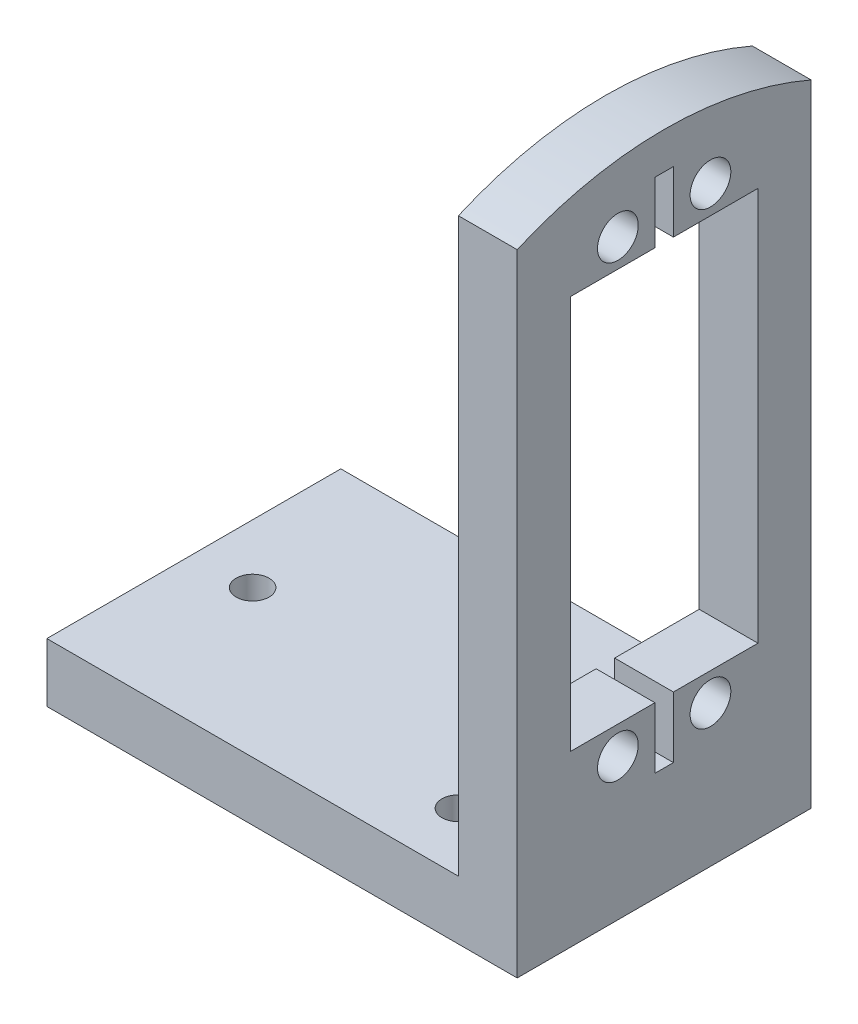
ISO-10303-21;
HEADER;
FILE_DESCRIPTION(('STEP AP214'),'2;1');
FILE_NAME('part.step','',(''),(''),'','','');
FILE_SCHEMA(('AUTOMOTIVE_DESIGN { 1 0 10303 214 1 1 1 1 }'));
ENDSEC;
DATA;
#1=APPLICATION_CONTEXT('core data for automotive mechanical design processes');
#2=APPLICATION_PROTOCOL_DEFINITION('international standard','automotive_design',2000,#1);
#3=PRODUCT_CONTEXT('',#1,'mechanical');
#4=PRODUCT('Part','Part','',(#3));
#5=PRODUCT_RELATED_PRODUCT_CATEGORY('part','',(#4));
#6=PRODUCT_DEFINITION_FORMATION('','',#4);
#7=PRODUCT_DEFINITION_CONTEXT('part definition',#1,'design');
#8=PRODUCT_DEFINITION('design','',#6,#7);
#9=PRODUCT_DEFINITION_SHAPE('','',#8);
#10=(LENGTH_UNIT() NAMED_UNIT(*) SI_UNIT(.MILLI.,.METRE.));
#11=(NAMED_UNIT(*) PLANE_ANGLE_UNIT() SI_UNIT($,.RADIAN.));
#12=(NAMED_UNIT(*) SI_UNIT($,.STERADIAN.) SOLID_ANGLE_UNIT());
#13=UNCERTAINTY_MEASURE_WITH_UNIT(LENGTH_MEASURE(1.E-05),#10,'distance_accuracy_value','');
#14=(GEOMETRIC_REPRESENTATION_CONTEXT(3) GLOBAL_UNCERTAINTY_ASSIGNED_CONTEXT((#13)) GLOBAL_UNIT_ASSIGNED_CONTEXT((#10,
#11,#12)) REPRESENTATION_CONTEXT('',''));
#15=CARTESIAN_POINT('',(0.,0.,0.));
#16=DIRECTION('',(0.,0.,1.));
#17=DIRECTION('',(1.,0.,0.));
#18=AXIS2_PLACEMENT_3D('',#15,#16,#17);
#19=CARTESIAN_POINT('',(6.35,0.,0.));
#20=DIRECTION('',(-1.,0.,0.));
#21=DIRECTION('',(0.,0.,1.));
#22=AXIS2_PLACEMENT_3D('',#19,#20,#21);
#23=PLANE('',#22);
#24=CARTESIAN_POINT('',(6.35,57.535000119,-20.875000033));
#25=DIRECTION('',(1.,0.,0.));
#26=DIRECTION('',(0.,0.,-1.));
#27=AXIS2_PLACEMENT_3D('',#24,#25,#26);
#28=CIRCLE('',#27,2.20000004499998);
#29=CARTESIAN_POINT('',(6.35,57.535000119,-23.075000078));
#30=VERTEX_POINT('',#29);
#31=EDGE_CURVE('E298',#30,#30,#28,.T.);
#32=ORIENTED_EDGE('',*,*,#31,.F.);
#33=EDGE_LOOP('',(#32));
#34=FACE_BOUND('',#33,.T.);
#35=CARTESIAN_POINT('',(6.35,57.535000119,-10.874999967));
#36=DIRECTION('',(1.,0.,0.));
#37=DIRECTION('',(0.,0.,-1.));
#38=AXIS2_PLACEMENT_3D('',#35,#36,#37);
#39=CIRCLE('',#38,2.20000004499999);
#40=CARTESIAN_POINT('',(6.35,57.535000119,-13.075000012));
#41=VERTEX_POINT('',#40);
#42=EDGE_CURVE('E304',#41,#41,#39,.T.);
#43=ORIENTED_EDGE('',*,*,#42,.F.);
#44=EDGE_LOOP('',(#43));
#45=FACE_BOUND('',#44,.T.);
#46=CARTESIAN_POINT('',(6.35,8.93500003700001,-20.875000033));
#47=DIRECTION('',(1.,0.,0.));
#48=DIRECTION('',(0.,0.,-1.));
#49=AXIS2_PLACEMENT_3D('',#46,#47,#48);
#50=CIRCLE('',#49,2.200000045);
#51=CARTESIAN_POINT('',(6.35,8.93500003700001,-23.075000078));
#52=VERTEX_POINT('',#51);
#53=EDGE_CURVE('E310',#52,#52,#50,.T.);
#54=ORIENTED_EDGE('',*,*,#53,.F.);
#55=EDGE_LOOP('',(#54));
#56=FACE_BOUND('',#55,.T.);
#57=CARTESIAN_POINT('',(6.35,8.93500003700001,-10.874999967));
#58=DIRECTION('',(1.,0.,0.));
#59=DIRECTION('',(0.,0.,-1.));
#60=AXIS2_PLACEMENT_3D('',#57,#58,#59);
#61=CIRCLE('',#60,2.200000045);
#62=CARTESIAN_POINT('',(6.35,8.93500003700001,-13.075000012));
#63=VERTEX_POINT('',#62);
#64=EDGE_CURVE('E186',#63,#63,#61,.T.);
#65=ORIENTED_EDGE('',*,*,#64,.F.);
#66=EDGE_LOOP('',(#65));
#67=FACE_BOUND('',#66,.T.);
#68=DIRECTION('',(0.,1.,0.));
#69=VECTOR('',#68,1.);
#70=CARTESIAN_POINT('',(6.35,0.,-31.75));
#71=LINE('',#70,#69);
#72=CARTESIAN_POINT('',(6.35,-6.34999999999999,-31.75));
#73=VERTEX_POINT('',#72);
#74=CARTESIAN_POINT('',(6.35,61.774194578712,-31.75));
#75=VERTEX_POINT('',#74);
#76=EDGE_CURVE('E11',#73,#75,#71,.T.);
#77=ORIENTED_EDGE('',*,*,#76,.T.);
#78=CARTESIAN_POINT('',(6.35,25.4,-15.875));
#79=DIRECTION('',(-1.,0.,0.));
#80=DIRECTION('',(0.,0.,-1.));
#81=AXIS2_PLACEMENT_3D('',#78,#79,#80);
#82=CIRCLE('',#81,39.6875);
#83=CARTESIAN_POINT('',(6.35,61.774194578712,0.));
#84=VERTEX_POINT('',#83);
#85=EDGE_CURVE('E53',#84,#75,#82,.T.);
#86=ORIENTED_EDGE('',*,*,#85,.F.);
#87=DIRECTION('',(0.,-1.,0.));
#88=VECTOR('',#87,1.);
#89=CARTESIAN_POINT('',(6.35,0.,0.));
#90=LINE('',#89,#88);
#91=CARTESIAN_POINT('',(6.35,-6.35,0.));
#92=VERTEX_POINT('',#91);
#93=EDGE_CURVE('E45',#84,#92,#90,.T.);
#94=ORIENTED_EDGE('',*,*,#93,.T.);
#95=DIRECTION('',(0.,0.,-1.));
#96=VECTOR('',#95,1.);
#97=CARTESIAN_POINT('',(6.35,-6.35,0.));
#98=LINE('',#97,#96);
#99=EDGE_CURVE('E697',#92,#73,#98,.T.);
#100=ORIENTED_EDGE('',*,*,#99,.T.);
#101=EDGE_LOOP('',(#77,#86,#94,#100));
#102=FACE_BOUND('',#101,.T.);
#103=DIRECTION('',(0.,-1.,0.));
#104=VECTOR('',#103,1.);
#105=CARTESIAN_POINT('',(6.35,54.507500078,-5.74800006099999));
#106=LINE('',#105,#104);
#107=CARTESIAN_POINT('',(6.35,54.507500078,-5.74800006099999));
#108=VERTEX_POINT('',#107);
#109=CARTESIAN_POINT('',(6.35,11.962500078,-5.74800006099999));
#110=VERTEX_POINT('',#109);
#111=EDGE_CURVE('E213',#108,#110,#106,.T.);
#112=ORIENTED_EDGE('',*,*,#111,.F.);
#113=DIRECTION('',(0.,0.,1.));
#114=VECTOR('',#113,1.);
#115=CARTESIAN_POINT('',(6.35,54.507500078,-5.74800006099999));
#116=LINE('',#115,#114);
#117=CARTESIAN_POINT('',(6.35,54.507500078,-14.875));
#118=VERTEX_POINT('',#117);
#119=EDGE_CURVE('E236',#118,#108,#116,.T.);
#120=ORIENTED_EDGE('',*,*,#119,.F.);
#121=DIRECTION('',(0.,-1.,0.));
#122=VECTOR('',#121,1.);
#123=CARTESIAN_POINT('',(6.35,54.507500078,-14.875));
#124=LINE('',#123,#122);
#125=CARTESIAN_POINT('',(6.35,61.1115000779998,-14.875));
#126=VERTEX_POINT('',#125);
#127=EDGE_CURVE('E234',#126,#118,#124,.T.);
#128=ORIENTED_EDGE('',*,*,#127,.F.);
#129=DIRECTION('',(0.,0.,1.));
#130=VECTOR('',#129,1.);
#131=CARTESIAN_POINT('',(6.35,61.1115000779998,-14.875));
#132=LINE('',#131,#130);
#133=CARTESIAN_POINT('',(6.35,61.1115000779998,-16.875));
#134=VERTEX_POINT('',#133);
#135=EDGE_CURVE('E232',#134,#126,#132,.T.);
#136=ORIENTED_EDGE('',*,*,#135,.F.);
#137=DIRECTION('',(0.,1.,0.));
#138=VECTOR('',#137,1.);
#139=CARTESIAN_POINT('',(6.35,54.507500078,-16.875));
#140=LINE('',#139,#138);
#141=CARTESIAN_POINT('',(6.35,54.507500078,-16.875));
#142=VERTEX_POINT('',#141);
#143=EDGE_CURVE('E230',#142,#134,#140,.T.);
#144=ORIENTED_EDGE('',*,*,#143,.F.);
#145=DIRECTION('',(0.,0.,1.));
#146=VECTOR('',#145,1.);
#147=CARTESIAN_POINT('',(6.35,54.507500078,-16.875));
#148=LINE('',#147,#146);
#149=CARTESIAN_POINT('',(6.35,54.507500078,-26.001999939));
#150=VERTEX_POINT('',#149);
#151=EDGE_CURVE('E228',#150,#142,#148,.T.);
#152=ORIENTED_EDGE('',*,*,#151,.F.);
#153=DIRECTION('',(0.,1.,0.));
#154=VECTOR('',#153,1.);
#155=CARTESIAN_POINT('',(6.35,54.507500078,-26.001999939));
#156=LINE('',#155,#154);
#157=CARTESIAN_POINT('',(6.35,11.962500078,-26.001999939));
#158=VERTEX_POINT('',#157);
#159=EDGE_CURVE('E226',#158,#150,#156,.T.);
#160=ORIENTED_EDGE('',*,*,#159,.F.);
#161=DIRECTION('',(0.,0.,-1.));
#162=VECTOR('',#161,1.);
#163=CARTESIAN_POINT('',(6.35,11.962500078,-16.875));
#164=LINE('',#163,#162);
#165=CARTESIAN_POINT('',(6.35,11.962500078,-16.875));
#166=VERTEX_POINT('',#165);
#167=EDGE_CURVE('E224',#166,#158,#164,.T.);
#168=ORIENTED_EDGE('',*,*,#167,.F.);
#169=DIRECTION('',(0.,1.,0.));
#170=VECTOR('',#169,1.);
#171=CARTESIAN_POINT('',(6.35,11.962500078,-16.875));
#172=LINE('',#171,#170);
#173=CARTESIAN_POINT('',(6.35,5.358500078,-16.875));
#174=VERTEX_POINT('',#173);
#175=EDGE_CURVE('E222',#174,#166,#172,.T.);
#176=ORIENTED_EDGE('',*,*,#175,.F.);
#177=DIRECTION('',(0.,-1.20129600711394E-13,-1.));
#178=VECTOR('',#177,1.);
#179=CARTESIAN_POINT('',(6.35,5.35850007800024,-14.875));
#180=LINE('',#179,#178);
#181=CARTESIAN_POINT('',(6.35,5.35850007800024,-14.875));
#182=VERTEX_POINT('',#181);
#183=EDGE_CURVE('E220',#182,#174,#180,.T.);
#184=ORIENTED_EDGE('',*,*,#183,.F.);
#185=DIRECTION('',(0.,-1.,0.));
#186=VECTOR('',#185,1.);
#187=CARTESIAN_POINT('',(6.35,11.962500078,-14.875));
#188=LINE('',#187,#186);
#189=CARTESIAN_POINT('',(6.35,11.962500078,-14.875));
#190=VERTEX_POINT('',#189);
#191=EDGE_CURVE('E218',#190,#182,#188,.T.);
#192=ORIENTED_EDGE('',*,*,#191,.F.);
#193=DIRECTION('',(0.,0.,-1.));
#194=VECTOR('',#193,1.);
#195=CARTESIAN_POINT('',(6.35,11.962500078,-5.74800006099999));
#196=LINE('',#195,#194);
#197=EDGE_CURVE('E215',#110,#190,#196,.T.);
#198=ORIENTED_EDGE('',*,*,#197,.F.);
#199=EDGE_LOOP('',(#112,#120,#128,#136,#144,#152,#160,#168,#176,#184,#192,#198));
#200=FACE_BOUND('',#199,.T.);
#201=ADVANCED_FACE('F36',(#34,#45,#56,#67,#102,#200),#23,.F.);
#202=CARTESIAN_POINT('',(0.,0.,0.));
#203=DIRECTION('',(-1.,0.,0.));
#204=DIRECTION('',(0.,0.,1.));
#205=AXIS2_PLACEMENT_3D('',#202,#203,#204);
#206=PLANE('',#205);
#207=CARTESIAN_POINT('',(0.,25.4,-15.875));
#208=DIRECTION('',(-1.,0.,0.));
#209=DIRECTION('',(0.,0.,1.));
#210=AXIS2_PLACEMENT_3D('',#207,#208,#209);
#211=CIRCLE('',#210,39.6875);
#212=CARTESIAN_POINT('',(0.,61.774194578712,-31.75));
#213=VERTEX_POINT('',#212);
#214=CARTESIAN_POINT('',(0.,61.774194578712,0.));
#215=VERTEX_POINT('',#214);
#216=EDGE_CURVE('E164',#213,#215,#211,.F.);
#217=ORIENTED_EDGE('',*,*,#216,.F.);
#218=DIRECTION('',(0.,1.,0.));
#219=VECTOR('',#218,1.);
#220=CARTESIAN_POINT('',(0.,0.,-31.75));
#221=LINE('',#220,#219);
#222=CARTESIAN_POINT('',(0.,0.,-31.75));
#223=VERTEX_POINT('',#222);
#224=EDGE_CURVE('E40',#223,#213,#221,.T.);
#225=ORIENTED_EDGE('',*,*,#224,.F.);
#226=DIRECTION('',(0.,0.,-1.));
#227=VECTOR('',#226,1.);
#228=CARTESIAN_POINT('',(0.,0.,0.));
#229=LINE('',#228,#227);
#230=CARTESIAN_POINT('',(0.,0.,0.));
#231=VERTEX_POINT('',#230);
#232=EDGE_CURVE('E180',#231,#223,#229,.T.);
#233=ORIENTED_EDGE('',*,*,#232,.F.);
#234=DIRECTION('',(0.,-1.,0.));
#235=VECTOR('',#234,1.);
#236=CARTESIAN_POINT('',(0.,0.,0.));
#237=LINE('',#236,#235);
#238=EDGE_CURVE('E185',#215,#231,#237,.T.);
#239=ORIENTED_EDGE('',*,*,#238,.F.);
#240=EDGE_LOOP('',(#217,#225,#233,#239));
#241=FACE_BOUND('',#240,.T.);
#242=CARTESIAN_POINT('',(0.,57.535000119,-10.874999967));
#243=DIRECTION('',(1.,0.,0.));
#244=DIRECTION('',(0.,0.,-1.));
#245=AXIS2_PLACEMENT_3D('',#242,#243,#244);
#246=CIRCLE('',#245,2.20000004499999);
#247=CARTESIAN_POINT('',(0.,57.535000119,-13.075000012));
#248=VERTEX_POINT('',#247);
#249=EDGE_CURVE('E301',#248,#248,#246,.T.);
#250=ORIENTED_EDGE('',*,*,#249,.T.);
#251=EDGE_LOOP('',(#250));
#252=FACE_BOUND('',#251,.T.);
#253=CARTESIAN_POINT('',(0.,8.93500003700001,-10.874999967));
#254=DIRECTION('',(1.,0.,0.));
#255=DIRECTION('',(0.,0.,-1.));
#256=AXIS2_PLACEMENT_3D('',#253,#254,#255);
#257=CIRCLE('',#256,2.200000045);
#258=CARTESIAN_POINT('',(0.,8.93500003700001,-13.075000012));
#259=VERTEX_POINT('',#258);
#260=EDGE_CURVE('E182',#259,#259,#257,.T.);
#261=ORIENTED_EDGE('',*,*,#260,.T.);
#262=EDGE_LOOP('',(#261));
#263=FACE_BOUND('',#262,.T.);
#264=CARTESIAN_POINT('',(0.,8.93500003700001,-20.875000033));
#265=DIRECTION('',(1.,0.,0.));
#266=DIRECTION('',(0.,0.,-1.));
#267=AXIS2_PLACEMENT_3D('',#264,#265,#266);
#268=CIRCLE('',#267,2.200000045);
#269=CARTESIAN_POINT('',(0.,8.93500003700001,-23.075000078));
#270=VERTEX_POINT('',#269);
#271=EDGE_CURVE('E307',#270,#270,#268,.T.);
#272=ORIENTED_EDGE('',*,*,#271,.T.);
#273=EDGE_LOOP('',(#272));
#274=FACE_BOUND('',#273,.T.);
#275=CARTESIAN_POINT('',(0.,57.535000119,-20.875000033));
#276=DIRECTION('',(1.,0.,0.));
#277=DIRECTION('',(0.,0.,-1.));
#278=AXIS2_PLACEMENT_3D('',#275,#276,#277);
#279=CIRCLE('',#278,2.20000004499998);
#280=CARTESIAN_POINT('',(0.,57.535000119,-23.075000078));
#281=VERTEX_POINT('',#280);
#282=EDGE_CURVE('E297',#281,#281,#279,.T.);
#283=ORIENTED_EDGE('',*,*,#282,.T.);
#284=EDGE_LOOP('',(#283));
#285=FACE_BOUND('',#284,.T.);
#286=DIRECTION('',(0.,0.,1.));
#287=VECTOR('',#286,1.);
#288=CARTESIAN_POINT('',(0.,54.507500078,-5.74800006099999));
#289=LINE('',#288,#287);
#290=CARTESIAN_POINT('',(0.,54.507500078,-14.875));
#291=VERTEX_POINT('',#290);
#292=CARTESIAN_POINT('',(0.,54.507500078,-5.74800006099999));
#293=VERTEX_POINT('',#292);
#294=EDGE_CURVE('E216',#291,#293,#289,.T.);
#295=ORIENTED_EDGE('',*,*,#294,.T.);
#296=DIRECTION('',(0.,-1.,0.));
#297=VECTOR('',#296,1.);
#298=CARTESIAN_POINT('',(0.,54.507500078,-5.74800006099999));
#299=LINE('',#298,#297);
#300=CARTESIAN_POINT('',(0.,11.962500078,-5.74800006099999));
#301=VERTEX_POINT('',#300);
#302=EDGE_CURVE('E205',#293,#301,#299,.T.);
#303=ORIENTED_EDGE('',*,*,#302,.T.);
#304=DIRECTION('',(0.,0.,-1.));
#305=VECTOR('',#304,1.);
#306=CARTESIAN_POINT('',(0.,11.962500078,-5.74800006099999));
#307=LINE('',#306,#305);
#308=CARTESIAN_POINT('',(0.,11.962500078,-14.875));
#309=VERTEX_POINT('',#308);
#310=EDGE_CURVE('E241',#301,#309,#307,.T.);
#311=ORIENTED_EDGE('',*,*,#310,.T.);
#312=DIRECTION('',(0.,-1.,0.));
#313=VECTOR('',#312,1.);
#314=CARTESIAN_POINT('',(0.,11.962500078,-14.875));
#315=LINE('',#314,#313);
#316=CARTESIAN_POINT('',(0.,5.35850007800024,-14.875));
#317=VERTEX_POINT('',#316);
#318=EDGE_CURVE('E244',#309,#317,#315,.T.);
#319=ORIENTED_EDGE('',*,*,#318,.T.);
#320=DIRECTION('',(0.,-1.20129600711394E-13,-1.));
#321=VECTOR('',#320,1.);
#322=CARTESIAN_POINT('',(0.,5.35850007800024,-14.875));
#323=LINE('',#322,#321);
#324=CARTESIAN_POINT('',(0.,5.358500078,-16.875));
#325=VERTEX_POINT('',#324);
#326=EDGE_CURVE('E247',#317,#325,#323,.T.);
#327=ORIENTED_EDGE('',*,*,#326,.T.);
#328=DIRECTION('',(0.,1.,0.));
#329=VECTOR('',#328,1.);
#330=CARTESIAN_POINT('',(0.,11.962500078,-16.875));
#331=LINE('',#330,#329);
#332=CARTESIAN_POINT('',(0.,11.962500078,-16.875));
#333=VERTEX_POINT('',#332);
#334=EDGE_CURVE('E250',#325,#333,#331,.T.);
#335=ORIENTED_EDGE('',*,*,#334,.T.);
#336=DIRECTION('',(0.,0.,-1.));
#337=VECTOR('',#336,1.);
#338=CARTESIAN_POINT('',(0.,11.962500078,-16.875));
#339=LINE('',#338,#337);
#340=CARTESIAN_POINT('',(0.,11.962500078,-26.001999939));
#341=VERTEX_POINT('',#340);
#342=EDGE_CURVE('E253',#333,#341,#339,.T.);
#343=ORIENTED_EDGE('',*,*,#342,.T.);
#344=DIRECTION('',(0.,1.,0.));
#345=VECTOR('',#344,1.);
#346=CARTESIAN_POINT('',(0.,54.507500078,-26.001999939));
#347=LINE('',#346,#345);
#348=CARTESIAN_POINT('',(0.,54.507500078,-26.001999939));
#349=VERTEX_POINT('',#348);
#350=EDGE_CURVE('E256',#341,#349,#347,.T.);
#351=ORIENTED_EDGE('',*,*,#350,.T.);
#352=DIRECTION('',(0.,0.,1.));
#353=VECTOR('',#352,1.);
#354=CARTESIAN_POINT('',(0.,54.507500078,-16.875));
#355=LINE('',#354,#353);
#356=CARTESIAN_POINT('',(0.,54.507500078,-16.875));
#357=VERTEX_POINT('',#356);
#358=EDGE_CURVE('E259',#349,#357,#355,.T.);
#359=ORIENTED_EDGE('',*,*,#358,.T.);
#360=DIRECTION('',(0.,1.,0.));
#361=VECTOR('',#360,1.);
#362=CARTESIAN_POINT('',(0.,54.507500078,-16.875));
#363=LINE('',#362,#361);
#364=CARTESIAN_POINT('',(0.,61.1115000779998,-16.875));
#365=VERTEX_POINT('',#364);
#366=EDGE_CURVE('E262',#357,#365,#363,.T.);
#367=ORIENTED_EDGE('',*,*,#366,.T.);
#368=DIRECTION('',(0.,0.,1.));
#369=VECTOR('',#368,1.);
#370=CARTESIAN_POINT('',(0.,61.1115000779998,-14.875));
#371=LINE('',#370,#369);
#372=CARTESIAN_POINT('',(0.,61.1115000779998,-14.875));
#373=VERTEX_POINT('',#372);
#374=EDGE_CURVE('E265',#365,#373,#371,.T.);
#375=ORIENTED_EDGE('',*,*,#374,.T.);
#376=DIRECTION('',(0.,-1.,0.));
#377=VECTOR('',#376,1.);
#378=CARTESIAN_POINT('',(0.,54.507500078,-14.875));
#379=LINE('',#378,#377);
#380=EDGE_CURVE('E268',#373,#291,#379,.T.);
#381=ORIENTED_EDGE('',*,*,#380,.T.);
#382=EDGE_LOOP('',(#295,#303,#311,#319,#327,#335,#343,#351,#359,#367,#375,#381));
#383=FACE_BOUND('',#382,.T.);
#384=ADVANCED_FACE('F320',(#241,#252,#263,#274,#285,#383),#206,.T.);
#385=CARTESIAN_POINT('',(6.35,0.,0.));
#386=DIRECTION('',(0.,0.,-1.));
#387=DIRECTION('',(0.,1.,0.));
#388=AXIS2_PLACEMENT_3D('',#385,#386,#387);
#389=PLANE('',#388);
#390=ORIENTED_EDGE('',*,*,#93,.F.);
#391=DIRECTION('',(1.,0.,0.));
#392=VECTOR('',#391,1.);
#393=CARTESIAN_POINT('',(-44.45,61.774194578712,0.));
#394=LINE('',#393,#392);
#395=EDGE_CURVE('E161',#215,#84,#394,.T.);
#396=ORIENTED_EDGE('',*,*,#395,.F.);
#397=ORIENTED_EDGE('',*,*,#238,.T.);
#398=DIRECTION('',(1.,0.,0.));
#399=VECTOR('',#398,1.);
#400=CARTESIAN_POINT('',(-44.45,0.,0.));
#401=LINE('',#400,#399);
#402=CARTESIAN_POINT('',(-44.45,0.,0.));
#403=VERTEX_POINT('',#402);
#404=EDGE_CURVE('E196',#403,#231,#401,.T.);
#405=ORIENTED_EDGE('',*,*,#404,.F.);
#406=DIRECTION('',(0.,-1.,0.));
#407=VECTOR('',#406,1.);
#408=CARTESIAN_POINT('',(-44.45,0.,0.));
#409=LINE('',#408,#407);
#410=CARTESIAN_POINT('',(-44.45,-6.35,0.));
#411=VERTEX_POINT('',#410);
#412=EDGE_CURVE('E712',#403,#411,#409,.T.);
#413=ORIENTED_EDGE('',*,*,#412,.T.);
#414=DIRECTION('',(1.,0.,0.));
#415=VECTOR('',#414,1.);
#416=CARTESIAN_POINT('',(-44.45,-6.35,0.));
#417=LINE('',#416,#415);
#418=EDGE_CURVE('E176',#411,#92,#417,.T.);
#419=ORIENTED_EDGE('',*,*,#418,.T.);
#420=EDGE_LOOP('',(#390,#396,#397,#405,#413,#419));
#421=FACE_BOUND('',#420,.T.);
#422=ADVANCED_FACE('F38',(#421),#389,.F.);
#423=CARTESIAN_POINT('',(6.35,0.,-31.75));
#424=DIRECTION('',(0.,0.,1.));
#425=DIRECTION('',(0.,-1.,0.));
#426=AXIS2_PLACEMENT_3D('',#423,#424,#425);
#427=PLANE('',#426);
#428=ORIENTED_EDGE('',*,*,#224,.T.);
#429=DIRECTION('',(1.,0.,0.));
#430=VECTOR('',#429,1.);
#431=CARTESIAN_POINT('',(-44.45,61.774194578712,-31.75));
#432=LINE('',#431,#430);
#433=EDGE_CURVE('E168',#213,#75,#432,.T.);
#434=ORIENTED_EDGE('',*,*,#433,.T.);
#435=ORIENTED_EDGE('',*,*,#76,.F.);
#436=DIRECTION('',(1.,0.,0.));
#437=VECTOR('',#436,1.);
#438=CARTESIAN_POINT('',(-44.45,-6.34999999999999,-31.75));
#439=LINE('',#438,#437);
#440=CARTESIAN_POINT('',(-44.45,-6.34999999999999,-31.75));
#441=VERTEX_POINT('',#440);
#442=EDGE_CURVE('E203',#441,#73,#439,.T.);
#443=ORIENTED_EDGE('',*,*,#442,.F.);
#444=DIRECTION('',(0.,1.,0.));
#445=VECTOR('',#444,1.);
#446=CARTESIAN_POINT('',(-44.45,0.,-31.75));
#447=LINE('',#446,#445);
#448=CARTESIAN_POINT('',(-44.45,0.,-31.75));
#449=VERTEX_POINT('',#448);
#450=EDGE_CURVE('E201',#441,#449,#447,.T.);
#451=ORIENTED_EDGE('',*,*,#450,.T.);
#452=DIRECTION('',(1.,0.,0.));
#453=VECTOR('',#452,1.);
#454=CARTESIAN_POINT('',(-44.45,0.,-31.75));
#455=LINE('',#454,#453);
#456=EDGE_CURVE('E194',#449,#223,#455,.T.);
#457=ORIENTED_EDGE('',*,*,#456,.T.);
#458=EDGE_LOOP('',(#428,#434,#435,#443,#451,#457));
#459=FACE_BOUND('',#458,.T.);
#460=ADVANCED_FACE('F199',(#459),#427,.F.);
#461=CARTESIAN_POINT('',(6.35,8.93500003700001,-10.874999967));
#462=DIRECTION('',(-1.,0.,0.));
#463=DIRECTION('',(0.,0.,1.));
#464=AXIS2_PLACEMENT_3D('',#461,#462,#463);
#465=CYLINDRICAL_SURFACE('',#464,2.200000045);
#466=ORIENTED_EDGE('',*,*,#64,.T.);
#467=EDGE_LOOP('',(#466));
#468=FACE_BOUND('',#467,.T.);
#469=ORIENTED_EDGE('',*,*,#260,.F.);
#470=EDGE_LOOP('',(#469));
#471=FACE_BOUND('',#470,.T.);
#472=ADVANCED_FACE('F323',(#468,#471),#465,.F.);
#473=CARTESIAN_POINT('',(6.35,8.93500003700001,-20.875000033));
#474=DIRECTION('',(-1.,0.,0.));
#475=DIRECTION('',(0.,0.,1.));
#476=AXIS2_PLACEMENT_3D('',#473,#474,#475);
#477=CYLINDRICAL_SURFACE('',#476,2.200000045);
#478=ORIENTED_EDGE('',*,*,#53,.T.);
#479=EDGE_LOOP('',(#478));
#480=FACE_BOUND('',#479,.T.);
#481=ORIENTED_EDGE('',*,*,#271,.F.);
#482=EDGE_LOOP('',(#481));
#483=FACE_BOUND('',#482,.T.);
#484=ADVANCED_FACE('F325',(#480,#483),#477,.F.);
#485=CARTESIAN_POINT('',(6.35,57.535000119,-10.874999967));
#486=DIRECTION('',(-1.,0.,0.));
#487=DIRECTION('',(0.,0.,1.));
#488=AXIS2_PLACEMENT_3D('',#485,#486,#487);
#489=CYLINDRICAL_SURFACE('',#488,2.20000004499999);
#490=ORIENTED_EDGE('',*,*,#42,.T.);
#491=EDGE_LOOP('',(#490));
#492=FACE_BOUND('',#491,.T.);
#493=ORIENTED_EDGE('',*,*,#249,.F.);
#494=EDGE_LOOP('',(#493));
#495=FACE_BOUND('',#494,.T.);
#496=ADVANCED_FACE('F331',(#492,#495),#489,.F.);
#497=CARTESIAN_POINT('',(6.35,57.535000119,-20.875000033));
#498=DIRECTION('',(-1.,0.,0.));
#499=DIRECTION('',(0.,0.,1.));
#500=AXIS2_PLACEMENT_3D('',#497,#498,#499);
#501=CYLINDRICAL_SURFACE('',#500,2.20000004499998);
#502=ORIENTED_EDGE('',*,*,#31,.T.);
#503=EDGE_LOOP('',(#502));
#504=FACE_BOUND('',#503,.T.);
#505=ORIENTED_EDGE('',*,*,#282,.F.);
#506=EDGE_LOOP('',(#505));
#507=FACE_BOUND('',#506,.T.);
#508=ADVANCED_FACE('F435',(#504,#507),#501,.F.);
#509=CARTESIAN_POINT('',(6.35,54.507500078,-5.74800006099999));
#510=DIRECTION('',(0.,0.,-1.));
#511=DIRECTION('',(0.,1.,0.));
#512=AXIS2_PLACEMENT_3D('',#509,#510,#511);
#513=PLANE('',#512);
#514=ORIENTED_EDGE('',*,*,#302,.F.);
#515=DIRECTION('',(-1.,0.,0.));
#516=VECTOR('',#515,1.);
#517=CARTESIAN_POINT('',(6.35,54.507500078,-5.74800006099999));
#518=LINE('',#517,#516);
#519=EDGE_CURVE('E238',#108,#293,#518,.T.);
#520=ORIENTED_EDGE('',*,*,#519,.F.);
#521=ORIENTED_EDGE('',*,*,#111,.T.);
#522=DIRECTION('',(-1.,0.,0.));
#523=VECTOR('',#522,1.);
#524=CARTESIAN_POINT('',(6.35,11.962500078,-5.74800006099999));
#525=LINE('',#524,#523);
#526=EDGE_CURVE('E294',#110,#301,#525,.T.);
#527=ORIENTED_EDGE('',*,*,#526,.T.);
#528=EDGE_LOOP('',(#514,#520,#521,#527));
#529=FACE_BOUND('',#528,.T.);
#530=ADVANCED_FACE('F358',(#529),#513,.T.);
#531=CARTESIAN_POINT('',(6.35,11.962500078,-5.74800006099999));
#532=DIRECTION('',(0.,1.,0.));
#533=DIRECTION('',(0.,0.,1.));
#534=AXIS2_PLACEMENT_3D('',#531,#532,#533);
#535=PLANE('',#534);
#536=ORIENTED_EDGE('',*,*,#310,.F.);
#537=ORIENTED_EDGE('',*,*,#526,.F.);
#538=ORIENTED_EDGE('',*,*,#197,.T.);
#539=DIRECTION('',(-1.,0.,0.));
#540=VECTOR('',#539,1.);
#541=CARTESIAN_POINT('',(6.35,11.962500078,-14.875));
#542=LINE('',#541,#540);
#543=EDGE_CURVE('E292',#190,#309,#542,.T.);
#544=ORIENTED_EDGE('',*,*,#543,.T.);
#545=EDGE_LOOP('',(#536,#537,#538,#544));
#546=FACE_BOUND('',#545,.T.);
#547=ADVANCED_FACE('F366',(#546),#535,.T.);
#548=CARTESIAN_POINT('',(6.35,11.962500078,-14.875));
#549=DIRECTION('',(0.,0.,-1.));
#550=DIRECTION('',(0.,1.,0.));
#551=AXIS2_PLACEMENT_3D('',#548,#549,#550);
#552=PLANE('',#551);
#553=ORIENTED_EDGE('',*,*,#318,.F.);
#554=ORIENTED_EDGE('',*,*,#543,.F.);
#555=ORIENTED_EDGE('',*,*,#191,.T.);
#556=DIRECTION('',(-1.,0.,0.));
#557=VECTOR('',#556,1.);
#558=CARTESIAN_POINT('',(6.35,5.35850007800024,-14.875));
#559=LINE('',#558,#557);
#560=EDGE_CURVE('E290',#182,#317,#559,.T.);
#561=ORIENTED_EDGE('',*,*,#560,.T.);
#562=EDGE_LOOP('',(#553,#554,#555,#561));
#563=FACE_BOUND('',#562,.T.);
#564=ADVANCED_FACE('F369',(#563),#552,.T.);
#565=CARTESIAN_POINT('',(6.35,5.35850007800024,-14.875));
#566=DIRECTION('',(0.,1.,-1.20129600711394E-13));
#567=DIRECTION('',(0.,1.20129600711394E-13,1.));
#568=AXIS2_PLACEMENT_3D('',#565,#566,#567);
#569=PLANE('',#568);
#570=ORIENTED_EDGE('',*,*,#326,.F.);
#571=ORIENTED_EDGE('',*,*,#560,.F.);
#572=ORIENTED_EDGE('',*,*,#183,.T.);
#573=DIRECTION('',(-1.,0.,0.));
#574=VECTOR('',#573,1.);
#575=CARTESIAN_POINT('',(6.35,5.358500078,-16.875));
#576=LINE('',#575,#574);
#577=EDGE_CURVE('E288',#174,#325,#576,.T.);
#578=ORIENTED_EDGE('',*,*,#577,.T.);
#579=EDGE_LOOP('',(#570,#571,#572,#578));
#580=FACE_BOUND('',#579,.T.);
#581=ADVANCED_FACE('F374',(#580),#569,.T.);
#582=CARTESIAN_POINT('',(6.35,11.962500078,-16.875));
#583=DIRECTION('',(0.,0.,1.));
#584=DIRECTION('',(1.,0.,0.));
#585=AXIS2_PLACEMENT_3D('',#582,#583,#584);
#586=PLANE('',#585);
#587=ORIENTED_EDGE('',*,*,#334,.F.);
#588=ORIENTED_EDGE('',*,*,#577,.F.);
#589=ORIENTED_EDGE('',*,*,#175,.T.);
#590=DIRECTION('',(-1.,0.,0.));
#591=VECTOR('',#590,1.);
#592=CARTESIAN_POINT('',(6.35,11.962500078,-16.875));
#593=LINE('',#592,#591);
#594=EDGE_CURVE('E286',#166,#333,#593,.T.);
#595=ORIENTED_EDGE('',*,*,#594,.T.);
#596=EDGE_LOOP('',(#587,#588,#589,#595));
#597=FACE_BOUND('',#596,.T.);
#598=ADVANCED_FACE('F378',(#597),#586,.T.);
#599=CARTESIAN_POINT('',(6.35,11.962500078,-16.875));
#600=DIRECTION('',(0.,1.,0.));
#601=DIRECTION('',(0.,0.,1.));
#602=AXIS2_PLACEMENT_3D('',#599,#600,#601);
#603=PLANE('',#602);
#604=ORIENTED_EDGE('',*,*,#342,.F.);
#605=ORIENTED_EDGE('',*,*,#594,.F.);
#606=ORIENTED_EDGE('',*,*,#167,.T.);
#607=DIRECTION('',(-1.,0.,0.));
#608=VECTOR('',#607,1.);
#609=CARTESIAN_POINT('',(6.35,11.962500078,-26.001999939));
#610=LINE('',#609,#608);
#611=EDGE_CURVE('E284',#158,#341,#610,.T.);
#612=ORIENTED_EDGE('',*,*,#611,.T.);
#613=EDGE_LOOP('',(#604,#605,#606,#612));
#614=FACE_BOUND('',#613,.T.);
#615=ADVANCED_FACE('F383',(#614),#603,.T.);
#616=CARTESIAN_POINT('',(6.35,54.507500078,-26.001999939));
#617=DIRECTION('',(0.,0.,1.));
#618=DIRECTION('',(0.,-1.,0.));
#619=AXIS2_PLACEMENT_3D('',#616,#617,#618);
#620=PLANE('',#619);
#621=ORIENTED_EDGE('',*,*,#350,.F.);
#622=ORIENTED_EDGE('',*,*,#611,.F.);
#623=ORIENTED_EDGE('',*,*,#159,.T.);
#624=DIRECTION('',(-1.,0.,0.));
#625=VECTOR('',#624,1.);
#626=CARTESIAN_POINT('',(6.35,54.507500078,-26.001999939));
#627=LINE('',#626,#625);
#628=EDGE_CURVE('E282',#150,#349,#627,.T.);
#629=ORIENTED_EDGE('',*,*,#628,.T.);
#630=EDGE_LOOP('',(#621,#622,#623,#629));
#631=FACE_BOUND('',#630,.T.);
#632=ADVANCED_FACE('F388',(#631),#620,.T.);
#633=CARTESIAN_POINT('',(6.35,54.507500078,-16.875));
#634=DIRECTION('',(0.,-1.,0.));
#635=DIRECTION('',(0.,0.,-1.));
#636=AXIS2_PLACEMENT_3D('',#633,#634,#635);
#637=PLANE('',#636);
#638=ORIENTED_EDGE('',*,*,#358,.F.);
#639=ORIENTED_EDGE('',*,*,#628,.F.);
#640=ORIENTED_EDGE('',*,*,#151,.T.);
#641=DIRECTION('',(-1.,0.,0.));
#642=VECTOR('',#641,1.);
#643=CARTESIAN_POINT('',(6.35,54.507500078,-16.875));
#644=LINE('',#643,#642);
#645=EDGE_CURVE('E280',#142,#357,#644,.T.);
#646=ORIENTED_EDGE('',*,*,#645,.T.);
#647=EDGE_LOOP('',(#638,#639,#640,#646));
#648=FACE_BOUND('',#647,.T.);
#649=ADVANCED_FACE('F393',(#648),#637,.T.);
#650=CARTESIAN_POINT('',(6.35,54.507500078,-16.875));
#651=DIRECTION('',(0.,0.,1.));
#652=DIRECTION('',(0.,-1.,0.));
#653=AXIS2_PLACEMENT_3D('',#650,#651,#652);
#654=PLANE('',#653);
#655=ORIENTED_EDGE('',*,*,#366,.F.);
#656=ORIENTED_EDGE('',*,*,#645,.F.);
#657=ORIENTED_EDGE('',*,*,#143,.T.);
#658=DIRECTION('',(-1.,0.,0.));
#659=VECTOR('',#658,1.);
#660=CARTESIAN_POINT('',(6.35,61.1115000779998,-16.875));
#661=LINE('',#660,#659);
#662=EDGE_CURVE('E278',#134,#365,#661,.T.);
#663=ORIENTED_EDGE('',*,*,#662,.T.);
#664=EDGE_LOOP('',(#655,#656,#657,#663));
#665=FACE_BOUND('',#664,.T.);
#666=ADVANCED_FACE('F398',(#665),#654,.T.);
#667=CARTESIAN_POINT('',(6.35,61.1115000779998,-14.875));
#668=DIRECTION('',(0.,-1.,0.));
#669=DIRECTION('',(0.,0.,-1.));
#670=AXIS2_PLACEMENT_3D('',#667,#668,#669);
#671=PLANE('',#670);
#672=ORIENTED_EDGE('',*,*,#374,.F.);
#673=ORIENTED_EDGE('',*,*,#662,.F.);
#674=ORIENTED_EDGE('',*,*,#135,.T.);
#675=DIRECTION('',(-1.,0.,0.));
#676=VECTOR('',#675,1.);
#677=CARTESIAN_POINT('',(6.35,61.1115000779998,-14.875));
#678=LINE('',#677,#676);
#679=EDGE_CURVE('E276',#126,#373,#678,.T.);
#680=ORIENTED_EDGE('',*,*,#679,.T.);
#681=EDGE_LOOP('',(#672,#673,#674,#680));
#682=FACE_BOUND('',#681,.T.);
#683=ADVANCED_FACE('F402',(#682),#671,.T.);
#684=CARTESIAN_POINT('',(6.35,54.507500078,-14.875));
#685=DIRECTION('',(0.,0.,-1.));
#686=DIRECTION('',(0.,1.,0.));
#687=AXIS2_PLACEMENT_3D('',#684,#685,#686);
#688=PLANE('',#687);
#689=ORIENTED_EDGE('',*,*,#380,.F.);
#690=ORIENTED_EDGE('',*,*,#679,.F.);
#691=ORIENTED_EDGE('',*,*,#127,.T.);
#692=DIRECTION('',(-1.,0.,0.));
#693=VECTOR('',#692,1.);
#694=CARTESIAN_POINT('',(6.35,54.507500078,-14.875));
#695=LINE('',#694,#693);
#696=EDGE_CURVE('E61',#118,#291,#695,.T.);
#697=ORIENTED_EDGE('',*,*,#696,.T.);
#698=EDGE_LOOP('',(#689,#690,#691,#697));
#699=FACE_BOUND('',#698,.T.);
#700=ADVANCED_FACE('F406',(#699),#688,.T.);
#701=CARTESIAN_POINT('',(6.35,54.507500078,-5.74800006099999));
#702=DIRECTION('',(0.,-1.,0.));
#703=DIRECTION('',(0.,0.,-1.));
#704=AXIS2_PLACEMENT_3D('',#701,#702,#703);
#705=PLANE('',#704);
#706=ORIENTED_EDGE('',*,*,#294,.F.);
#707=ORIENTED_EDGE('',*,*,#696,.F.);
#708=ORIENTED_EDGE('',*,*,#119,.T.);
#709=ORIENTED_EDGE('',*,*,#519,.T.);
#710=EDGE_LOOP('',(#706,#707,#708,#709));
#711=FACE_BOUND('',#710,.T.);
#712=ADVANCED_FACE('F353',(#711),#705,.T.);
#713=CARTESIAN_POINT('',(-44.45,0.,0.));
#714=DIRECTION('',(0.,1.,0.));
#715=DIRECTION('',(0.,0.,1.));
#716=AXIS2_PLACEMENT_3D('',#713,#714,#715);
#717=PLANE('',#716);
#718=CARTESIAN_POINT('',(-6.35,0.,-6.35));
#719=DIRECTION('',(0.,1.,0.));
#720=DIRECTION('',(0.,0.,1.));
#721=AXIS2_PLACEMENT_3D('',#718,#719,#720);
#722=CIRCLE('',#721,1.777000002);
#723=CARTESIAN_POINT('',(-6.35,0.,-4.572999998));
#724=VERTEX_POINT('',#723);
#725=EDGE_CURVE('E694',#724,#724,#722,.T.);
#726=ORIENTED_EDGE('',*,*,#725,.F.);
#727=EDGE_LOOP('',(#726));
#728=FACE_BOUND('',#727,.T.);
#729=CARTESIAN_POINT('',(-6.35,0.,-25.4));
#730=DIRECTION('',(0.,1.,0.));
#731=DIRECTION('',(0.,0.,-1.));
#732=AXIS2_PLACEMENT_3D('',#729,#730,#731);
#733=CIRCLE('',#732,1.777000002);
#734=CARTESIAN_POINT('',(-6.35,0.,-27.177000002));
#735=VERTEX_POINT('',#734);
#736=EDGE_CURVE('E695',#735,#735,#733,.T.);
#737=ORIENTED_EDGE('',*,*,#736,.F.);
#738=EDGE_LOOP('',(#737));
#739=FACE_BOUND('',#738,.T.);
#740=CARTESIAN_POINT('',(-38.1,0.,-15.875));
#741=DIRECTION('',(0.,1.,0.));
#742=DIRECTION('',(0.,0.,1.));
#743=AXIS2_PLACEMENT_3D('',#740,#741,#742);
#744=CIRCLE('',#743,1.777000002);
#745=CARTESIAN_POINT('',(-38.1,0.,-14.097999998));
#746=VERTEX_POINT('',#745);
#747=EDGE_CURVE('E706',#746,#746,#744,.T.);
#748=ORIENTED_EDGE('',*,*,#747,.F.);
#749=EDGE_LOOP('',(#748));
#750=FACE_BOUND('',#749,.T.);
#751=ORIENTED_EDGE('',*,*,#404,.T.);
#752=ORIENTED_EDGE('',*,*,#232,.T.);
#753=ORIENTED_EDGE('',*,*,#456,.F.);
#754=DIRECTION('',(0.,0.,1.));
#755=VECTOR('',#754,1.);
#756=CARTESIAN_POINT('',(-44.45,0.,0.));
#757=LINE('',#756,#755);
#758=EDGE_CURVE('E212',#449,#403,#757,.T.);
#759=ORIENTED_EDGE('',*,*,#758,.T.);
#760=EDGE_LOOP('',(#751,#752,#753,#759));
#761=FACE_BOUND('',#760,.T.);
#762=ADVANCED_FACE('F192',(#728,#739,#750,#761),#717,.T.);
#763=CARTESIAN_POINT('',(-44.45,-6.35,0.));
#764=DIRECTION('',(0.,-1.,0.));
#765=DIRECTION('',(0.,0.,-1.));
#766=AXIS2_PLACEMENT_3D('',#763,#764,#765);
#767=PLANE('',#766);
#768=CARTESIAN_POINT('',(-6.35,-6.35,-6.35));
#769=DIRECTION('',(0.,1.,0.));
#770=DIRECTION('',(0.,0.,1.));
#771=AXIS2_PLACEMENT_3D('',#768,#769,#770);
#772=CIRCLE('',#771,1.777000002);
#773=CARTESIAN_POINT('',(-6.35,-6.35,-4.572999998));
#774=VERTEX_POINT('',#773);
#775=EDGE_CURVE('E691',#774,#774,#772,.T.);
#776=ORIENTED_EDGE('',*,*,#775,.T.);
#777=EDGE_LOOP('',(#776));
#778=FACE_BOUND('',#777,.T.);
#779=CARTESIAN_POINT('',(-6.35,-6.35,-25.4));
#780=DIRECTION('',(0.,1.,0.));
#781=DIRECTION('',(0.,0.,-1.));
#782=AXIS2_PLACEMENT_3D('',#779,#780,#781);
#783=CIRCLE('',#782,1.777000002);
#784=CARTESIAN_POINT('',(-6.35,-6.35,-27.177000002));
#785=VERTEX_POINT('',#784);
#786=EDGE_CURVE('E700',#785,#785,#783,.T.);
#787=ORIENTED_EDGE('',*,*,#786,.T.);
#788=EDGE_LOOP('',(#787));
#789=FACE_BOUND('',#788,.T.);
#790=CARTESIAN_POINT('',(-38.1,-6.35,-15.875));
#791=DIRECTION('',(0.,1.,0.));
#792=DIRECTION('',(0.,0.,1.));
#793=AXIS2_PLACEMENT_3D('',#790,#791,#792);
#794=CIRCLE('',#793,1.777000002);
#795=CARTESIAN_POINT('',(-38.1,-6.35,-14.097999998));
#796=VERTEX_POINT('',#795);
#797=EDGE_CURVE('E709',#796,#796,#794,.T.);
#798=ORIENTED_EDGE('',*,*,#797,.T.);
#799=EDGE_LOOP('',(#798));
#800=FACE_BOUND('',#799,.T.);
#801=ORIENTED_EDGE('',*,*,#99,.F.);
#802=ORIENTED_EDGE('',*,*,#418,.F.);
#803=DIRECTION('',(0.,0.,-1.));
#804=VECTOR('',#803,1.);
#805=CARTESIAN_POINT('',(-44.45,-6.35,0.));
#806=LINE('',#805,#804);
#807=EDGE_CURVE('E714',#411,#441,#806,.T.);
#808=ORIENTED_EDGE('',*,*,#807,.T.);
#809=ORIENTED_EDGE('',*,*,#442,.T.);
#810=EDGE_LOOP('',(#801,#802,#808,#809));
#811=FACE_BOUND('',#810,.T.);
#812=ADVANCED_FACE('F518',(#778,#789,#800,#811),#767,.T.);
#813=CARTESIAN_POINT('',(-44.45,0.,0.));
#814=DIRECTION('',(1.,0.,0.));
#815=DIRECTION('',(0.,0.,-1.));
#816=AXIS2_PLACEMENT_3D('',#813,#814,#815);
#817=PLANE('',#816);
#818=ORIENTED_EDGE('',*,*,#412,.F.);
#819=ORIENTED_EDGE('',*,*,#758,.F.);
#820=ORIENTED_EDGE('',*,*,#450,.F.);
#821=ORIENTED_EDGE('',*,*,#807,.F.);
#822=EDGE_LOOP('',(#818,#819,#820,#821));
#823=FACE_BOUND('',#822,.T.);
#824=ADVANCED_FACE('F512',(#823),#817,.F.);
#825=CARTESIAN_POINT('',(-38.1,-6.35,-15.875));
#826=DIRECTION('',(0.,1.,0.));
#827=DIRECTION('',(0.,0.,1.));
#828=AXIS2_PLACEMENT_3D('',#825,#826,#827);
#829=CYLINDRICAL_SURFACE('',#828,1.777000002);
#830=ORIENTED_EDGE('',*,*,#797,.F.);
#831=EDGE_LOOP('',(#830));
#832=FACE_BOUND('',#831,.T.);
#833=ORIENTED_EDGE('',*,*,#747,.T.);
#834=EDGE_LOOP('',(#833));
#835=FACE_BOUND('',#834,.T.);
#836=ADVANCED_FACE('F517',(#832,#835),#829,.F.);
#837=CARTESIAN_POINT('',(-6.35,-6.35,-25.4));
#838=DIRECTION('',(0.,1.,0.));
#839=DIRECTION('',(0.,0.,1.));
#840=AXIS2_PLACEMENT_3D('',#837,#838,#839);
#841=CYLINDRICAL_SURFACE('',#840,1.777000002);
#842=ORIENTED_EDGE('',*,*,#786,.F.);
#843=EDGE_LOOP('',(#842));
#844=FACE_BOUND('',#843,.T.);
#845=ORIENTED_EDGE('',*,*,#736,.T.);
#846=EDGE_LOOP('',(#845));
#847=FACE_BOUND('',#846,.T.);
#848=ADVANCED_FACE('F548',(#844,#847),#841,.F.);
#849=CARTESIAN_POINT('',(-6.35,-6.35,-6.35));
#850=DIRECTION('',(0.,1.,0.));
#851=DIRECTION('',(0.,0.,1.));
#852=AXIS2_PLACEMENT_3D('',#849,#850,#851);
#853=CYLINDRICAL_SURFACE('',#852,1.777000002);
#854=ORIENTED_EDGE('',*,*,#775,.F.);
#855=EDGE_LOOP('',(#854));
#856=FACE_BOUND('',#855,.T.);
#857=ORIENTED_EDGE('',*,*,#725,.T.);
#858=EDGE_LOOP('',(#857));
#859=FACE_BOUND('',#858,.T.);
#860=ADVANCED_FACE('F559',(#856,#859),#853,.F.);
#861=CARTESIAN_POINT('',(-44.45,25.4,-15.875));
#862=DIRECTION('',(1.,0.,0.));
#863=DIRECTION('',(0.,0.,-1.));
#864=AXIS2_PLACEMENT_3D('',#861,#862,#863);
#865=CYLINDRICAL_SURFACE('',#864,39.6875);
#866=ORIENTED_EDGE('',*,*,#216,.T.);
#867=ORIENTED_EDGE('',*,*,#395,.T.);
#868=ORIENTED_EDGE('',*,*,#85,.T.);
#869=ORIENTED_EDGE('',*,*,#433,.F.);
#870=EDGE_LOOP('',(#866,#867,#868,#869));
#871=FACE_BOUND('',#870,.T.);
#872=ADVANCED_FACE('F162',(#871),#865,.T.);
#873=CLOSED_SHELL('',(#201,#384,#422,#460,#472,#484,#496,#508,#530,#547,#564,#581,#598,#615,
#632,#649,#666,#683,#700,#712,#762,#812,#824,#836,#848,#860,#872));
#874=MANIFOLD_SOLID_BREP('B2',#873);
#875=ADVANCED_BREP_SHAPE_REPRESENTATION('',(#18,#874),#14);
#876=SHAPE_DEFINITION_REPRESENTATION(#9,#875);
ENDSEC;
END-ISO-10303-21;
